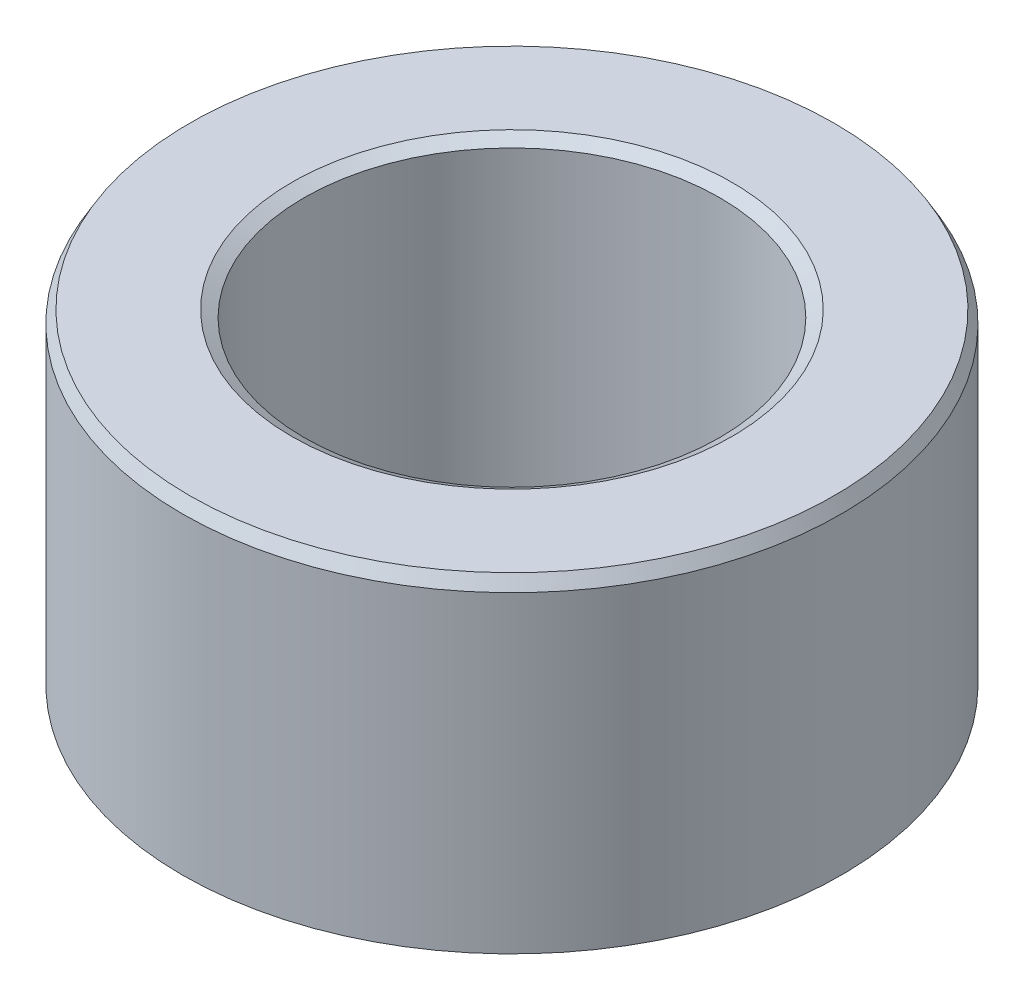
ISO-10303-21;
HEADER;
FILE_DESCRIPTION(('STEP AP214'),'2;1');
FILE_NAME('part.step','',(''),(''),'','','');
FILE_SCHEMA(('AUTOMOTIVE_DESIGN { 1 0 10303 214 1 1 1 1 }'));
ENDSEC;
DATA;
#1=APPLICATION_CONTEXT('core data for automotive mechanical design processes');
#2=APPLICATION_PROTOCOL_DEFINITION('international standard','automotive_design',2000,#1);
#3=PRODUCT_CONTEXT('',#1,'mechanical');
#4=PRODUCT('Part','Part','',(#3));
#5=PRODUCT_RELATED_PRODUCT_CATEGORY('part','',(#4));
#6=PRODUCT_DEFINITION_FORMATION('','',#4);
#7=PRODUCT_DEFINITION_CONTEXT('part definition',#1,'design');
#8=PRODUCT_DEFINITION('design','',#6,#7);
#9=PRODUCT_DEFINITION_SHAPE('','',#8);
#10=(LENGTH_UNIT() NAMED_UNIT(*) SI_UNIT(.MILLI.,.METRE.));
#11=(NAMED_UNIT(*) PLANE_ANGLE_UNIT() SI_UNIT($,.RADIAN.));
#12=(NAMED_UNIT(*) SI_UNIT($,.STERADIAN.) SOLID_ANGLE_UNIT());
#13=UNCERTAINTY_MEASURE_WITH_UNIT(LENGTH_MEASURE(1.E-05),#10,'distance_accuracy_value','');
#14=(GEOMETRIC_REPRESENTATION_CONTEXT(3) GLOBAL_UNCERTAINTY_ASSIGNED_CONTEXT((#13)) GLOBAL_UNIT_ASSIGNED_CONTEXT((#10,
#11,#12)) REPRESENTATION_CONTEXT('',''));
#15=CARTESIAN_POINT('',(0.,0.,0.));
#16=DIRECTION('',(0.,0.,1.));
#17=DIRECTION('',(1.,0.,0.));
#18=AXIS2_PLACEMENT_3D('',#15,#16,#17);
#19=CARTESIAN_POINT('',(0.,45.3636330230973,0.));
#20=DIRECTION('',(0.,-1.,0.));
#21=DIRECTION('',(0.,0.,-1.));
#22=AXIS2_PLACEMENT_3D('',#19,#20,#21);
#23=CYLINDRICAL_SURFACE('',#22,45.);
#24=CARTESIAN_POINT('',(0.,0.97076870545415,0.));
#25=DIRECTION('',(0.,1.,0.));
#26=DIRECTION('',(0.,0.,1.));
#27=AXIS2_PLACEMENT_3D('',#24,#25,#26);
#28=CIRCLE('',#27,45.);
#29=CARTESIAN_POINT('',(0.,0.97076870545415,45.));
#30=VERTEX_POINT('',#29);
#31=EDGE_CURVE('E10',#30,#30,#28,.T.);
#32=ORIENTED_EDGE('',*,*,#31,.T.);
#33=EDGE_LOOP('',(#32));
#34=FACE_BOUND('',#33,.T.);
#35=CARTESIAN_POINT('',(0.,43.6822123028528,0.));
#36=DIRECTION('',(0.,1.,0.));
#37=DIRECTION('',(0.,0.,1.));
#38=AXIS2_PLACEMENT_3D('',#35,#36,#37);
#39=CIRCLE('',#38,45.);
#40=CARTESIAN_POINT('',(0.,43.6822123028528,45.));
#41=VERTEX_POINT('',#40);
#42=EDGE_CURVE('E50',#41,#41,#39,.F.);
#43=ORIENTED_EDGE('',*,*,#42,.T.);
#44=EDGE_LOOP('',(#43));
#45=FACE_BOUND('',#44,.T.);
#46=ADVANCED_FACE('F39',(#34,#45),#23,.T.);
#47=CARTESIAN_POINT('',(0.,45.3636330230973,0.));
#48=DIRECTION('',(0.,1.,0.));
#49=DIRECTION('',(0.,0.,1.));
#50=AXIS2_PLACEMENT_3D('',#47,#48,#49);
#51=PLANE('',#50);
#52=CARTESIAN_POINT('',(0.,45.3636330230973,0.));
#53=DIRECTION('',(0.,1.,0.));
#54=DIRECTION('',(0.,0.,1.));
#55=AXIS2_PLACEMENT_3D('',#52,#53,#54);
#56=CIRCLE('',#55,30.0587417468735);
#57=CARTESIAN_POINT('',(0.,45.3636330230973,30.0587417468735));
#58=VERTEX_POINT('',#57);
#59=EDGE_CURVE('E58',#58,#58,#56,.F.);
#60=ORIENTED_EDGE('',*,*,#59,.T.);
#61=EDGE_LOOP('',(#60));
#62=FACE_BOUND('',#61,.T.);
#63=CARTESIAN_POINT('',(0.,45.3636330230973,0.));
#64=DIRECTION('',(0.,1.,0.));
#65=DIRECTION('',(0.,0.,1.));
#66=AXIS2_PLACEMENT_3D('',#63,#64,#65);
#67=CIRCLE('',#66,44.0292312945459);
#68=CARTESIAN_POINT('',(0.,45.3636330230973,44.0292312945459));
#69=VERTEX_POINT('',#68);
#70=EDGE_CURVE('E61',#69,#69,#67,.T.);
#71=ORIENTED_EDGE('',*,*,#70,.T.);
#72=EDGE_LOOP('',(#71));
#73=FACE_BOUND('',#72,.T.);
#74=ADVANCED_FACE('F88',(#62,#73),#51,.T.);
#75=CARTESIAN_POINT('',(0.,0.,0.));
#76=DIRECTION('',(0.,1.,0.));
#77=DIRECTION('',(0.,0.,1.));
#78=AXIS2_PLACEMENT_3D('',#75,#76,#77);
#79=PLANE('',#78);
#80=CARTESIAN_POINT('',(0.,0.,0.));
#81=DIRECTION('',(0.,1.,0.));
#82=DIRECTION('',(0.,0.,1.));
#83=AXIS2_PLACEMENT_3D('',#80,#81,#82);
#84=CIRCLE('',#83,29.3480897320832);
#85=CARTESIAN_POINT('',(0.,0.,29.3480897320832));
#86=VERTEX_POINT('',#85);
#87=EDGE_CURVE('E51',#86,#86,#84,.T.);
#88=ORIENTED_EDGE('',*,*,#87,.T.);
#89=EDGE_LOOP('',(#88));
#90=FACE_BOUND('',#89,.T.);
#91=CARTESIAN_POINT('',(0.,0.,0.));
#92=DIRECTION('',(0.,1.,0.));
#93=DIRECTION('',(0.,0.,1.));
#94=AXIS2_PLACEMENT_3D('',#91,#92,#93);
#95=CIRCLE('',#94,43.3185792797555);
#96=CARTESIAN_POINT('',(0.,0.,43.3185792797555));
#97=VERTEX_POINT('',#96);
#98=EDGE_CURVE('E54',#97,#97,#95,.F.);
#99=ORIENTED_EDGE('',*,*,#98,.T.);
#100=EDGE_LOOP('',(#99));
#101=FACE_BOUND('',#100,.T.);
#102=ADVANCED_FACE('F83',(#90,#101),#79,.F.);
#103=CARTESIAN_POINT('',(0.,45.3636330230973,0.));
#104=DIRECTION('',(0.,-1.,0.));
#105=DIRECTION('',(0.,0.,-1.));
#106=AXIS2_PLACEMENT_3D('',#103,#104,#105);
#107=CYLINDRICAL_SURFACE('',#106,28.377321026629);
#108=CARTESIAN_POINT('',(0.,44.3928643176431,0.));
#109=DIRECTION('',(0.,1.,0.));
#110=DIRECTION('',(0.,0.,1.));
#111=AXIS2_PLACEMENT_3D('',#108,#109,#110);
#112=CIRCLE('',#111,28.377321026629);
#113=CARTESIAN_POINT('',(0.,44.3928643176431,28.377321026629));
#114=VERTEX_POINT('',#113);
#115=EDGE_CURVE('E67',#114,#114,#112,.T.);
#116=ORIENTED_EDGE('',*,*,#115,.T.);
#117=EDGE_LOOP('',(#116));
#118=FACE_BOUND('',#117,.T.);
#119=CARTESIAN_POINT('',(0.,1.68142072024446,0.));
#120=DIRECTION('',(0.,1.,0.));
#121=DIRECTION('',(0.,0.,1.));
#122=AXIS2_PLACEMENT_3D('',#119,#120,#121);
#123=CIRCLE('',#122,28.377321026629);
#124=CARTESIAN_POINT('',(0.,1.68142072024446,28.377321026629));
#125=VERTEX_POINT('',#124);
#126=EDGE_CURVE('E69',#125,#125,#123,.F.);
#127=ORIENTED_EDGE('',*,*,#126,.T.);
#128=EDGE_LOOP('',(#127));
#129=FACE_BOUND('',#128,.T.);
#130=ADVANCED_FACE('F71',(#118,#129),#107,.F.);
#131=CARTESIAN_POINT('',(0.,44.3928643176431,0.));
#132=DIRECTION('',(0.,1.,0.));
#133=DIRECTION('',(0.,0.,1.));
#134=AXIS2_PLACEMENT_3D('',#131,#132,#133);
#135=CONICAL_SURFACE('',#134,28.377321026629,1.0471975511966);
#136=ORIENTED_EDGE('',*,*,#59,.F.);
#137=EDGE_LOOP('',(#136));
#138=FACE_BOUND('',#137,.T.);
#139=ORIENTED_EDGE('',*,*,#115,.F.);
#140=EDGE_LOOP('',(#139));
#141=FACE_BOUND('',#140,.T.);
#142=ADVANCED_FACE('F77',(#138,#141),#135,.F.);
#143=CARTESIAN_POINT('',(0.,0.,0.));
#144=DIRECTION('',(0.,-1.,0.));
#145=DIRECTION('',(0.,0.,-1.));
#146=AXIS2_PLACEMENT_3D('',#143,#144,#145);
#147=CONICAL_SURFACE('',#146,29.3480897320832,0.523598775598292);
#148=ORIENTED_EDGE('',*,*,#126,.F.);
#149=EDGE_LOOP('',(#148));
#150=FACE_BOUND('',#149,.T.);
#151=ORIENTED_EDGE('',*,*,#87,.F.);
#152=EDGE_LOOP('',(#151));
#153=FACE_BOUND('',#152,.T.);
#154=ADVANCED_FACE('F73',(#150,#153),#147,.F.);
#155=CARTESIAN_POINT('',(0.,0.97076870545415,0.));
#156=DIRECTION('',(0.,1.,0.));
#157=DIRECTION('',(0.,0.,1.));
#158=AXIS2_PLACEMENT_3D('',#155,#156,#157);
#159=CONICAL_SURFACE('',#158,45.,1.0471975511966);
#160=ORIENTED_EDGE('',*,*,#98,.F.);
#161=EDGE_LOOP('',(#160));
#162=FACE_BOUND('',#161,.T.);
#163=ORIENTED_EDGE('',*,*,#31,.F.);
#164=EDGE_LOOP('',(#163));
#165=FACE_BOUND('',#164,.T.);
#166=ADVANCED_FACE('F76',(#162,#165),#159,.T.);
#167=CARTESIAN_POINT('',(0.,45.3636330230973,0.));
#168=DIRECTION('',(0.,-1.,0.));
#169=DIRECTION('',(0.,0.,-1.));
#170=AXIS2_PLACEMENT_3D('',#167,#168,#169);
#171=CONICAL_SURFACE('',#170,44.0292312945459,0.523598775598293);
#172=ORIENTED_EDGE('',*,*,#42,.F.);
#173=EDGE_LOOP('',(#172));
#174=FACE_BOUND('',#173,.T.);
#175=ORIENTED_EDGE('',*,*,#70,.F.);
#176=EDGE_LOOP('',(#175));
#177=FACE_BOUND('',#176,.T.);
#178=ADVANCED_FACE('F45',(#174,#177),#171,.T.);
#179=CLOSED_SHELL('',(#46,#74,#102,#130,#142,#154,#166,#178));
#180=MANIFOLD_SOLID_BREP('B2',#179);
#181=ADVANCED_BREP_SHAPE_REPRESENTATION('',(#18,#180),#14);
#182=SHAPE_DEFINITION_REPRESENTATION(#9,#181);
ENDSEC;
END-ISO-10303-21;
